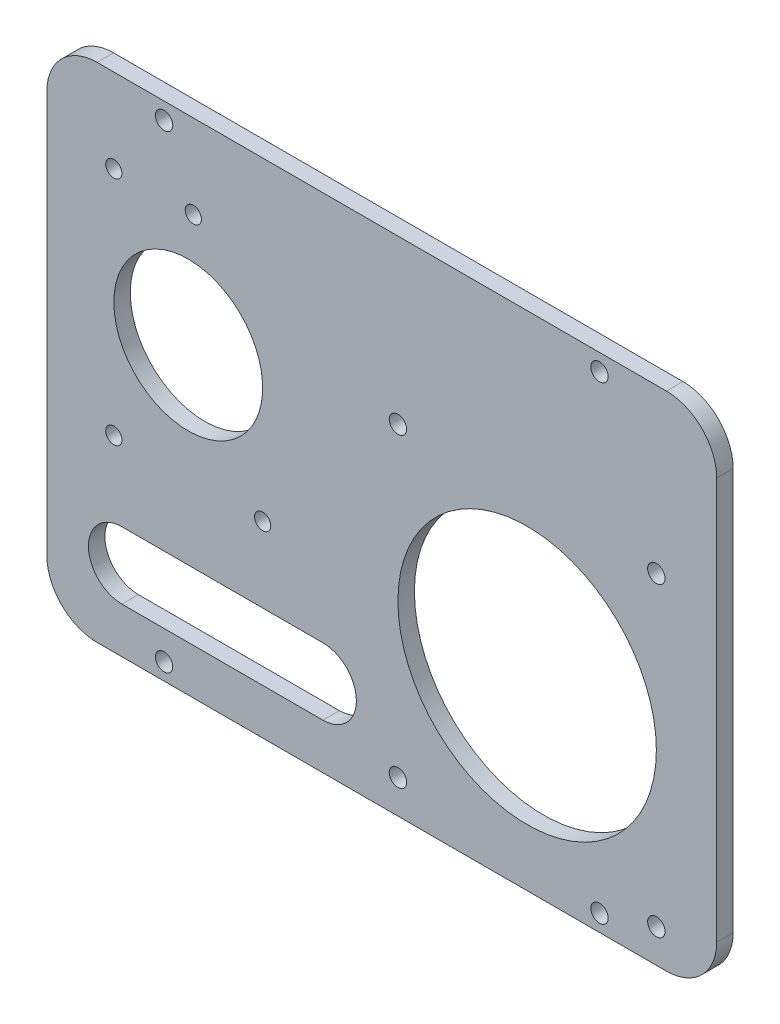
ISO-10303-21;
HEADER;
FILE_DESCRIPTION(('STEP AP214'),'2;1');
FILE_NAME('part.step','',(''),(''),'','','');
FILE_SCHEMA(('AUTOMOTIVE_DESIGN { 1 0 10303 214 1 1 1 1 }'));
ENDSEC;
DATA;
#1=APPLICATION_CONTEXT('core data for automotive mechanical design processes');
#2=APPLICATION_PROTOCOL_DEFINITION('international standard','automotive_design',2000,#1);
#3=PRODUCT_CONTEXT('',#1,'mechanical');
#4=PRODUCT('Part','Part','',(#3));
#5=PRODUCT_RELATED_PRODUCT_CATEGORY('part','',(#4));
#6=PRODUCT_DEFINITION_FORMATION('','',#4);
#7=PRODUCT_DEFINITION_CONTEXT('part definition',#1,'design');
#8=PRODUCT_DEFINITION('design','',#6,#7);
#9=PRODUCT_DEFINITION_SHAPE('','',#8);
#10=(LENGTH_UNIT() NAMED_UNIT(*) SI_UNIT(.MILLI.,.METRE.));
#11=(NAMED_UNIT(*) PLANE_ANGLE_UNIT() SI_UNIT($,.RADIAN.));
#12=(NAMED_UNIT(*) SI_UNIT($,.STERADIAN.) SOLID_ANGLE_UNIT());
#13=UNCERTAINTY_MEASURE_WITH_UNIT(LENGTH_MEASURE(1.E-05),#10,'distance_accuracy_value','');
#14=(GEOMETRIC_REPRESENTATION_CONTEXT(3) GLOBAL_UNCERTAINTY_ASSIGNED_CONTEXT((#13)) GLOBAL_UNIT_ASSIGNED_CONTEXT((#10,
#11,#12)) REPRESENTATION_CONTEXT('',''));
#15=CARTESIAN_POINT('',(0.,0.,0.));
#16=DIRECTION('',(0.,0.,1.));
#17=DIRECTION('',(1.,0.,0.));
#18=AXIS2_PLACEMENT_3D('',#15,#16,#17);
#19=CARTESIAN_POINT('',(-53.975,-38.1,3.1242));
#20=DIRECTION('',(0.,0.,-1.));
#21=DIRECTION('',(-1.,0.,0.));
#22=AXIS2_PLACEMENT_3D('',#19,#20,#21);
#23=CYLINDRICAL_SURFACE('',#22,9.525);
#24=CARTESIAN_POINT('',(-53.975,-38.1,0.));
#25=DIRECTION('',(0.,0.,1.));
#26=DIRECTION('',(-1.,0.,0.));
#27=AXIS2_PLACEMENT_3D('',#24,#25,#26);
#28=CIRCLE('',#27,9.525);
#29=CARTESIAN_POINT('',(-63.5,-38.0999999999999,0.));
#30=VERTEX_POINT('',#29);
#31=CARTESIAN_POINT('',(-53.9749999999999,-47.625,0.));
#32=VERTEX_POINT('',#31);
#33=EDGE_CURVE('E270',#30,#32,#28,.T.);
#34=ORIENTED_EDGE('',*,*,#33,.T.);
#35=DIRECTION('',(0.,0.,-1.));
#36=VECTOR('',#35,1.);
#37=CARTESIAN_POINT('',(-53.9749999999999,-47.625,3.1242));
#38=LINE('',#37,#36);
#39=CARTESIAN_POINT('',(-53.9749999999999,-47.625,3.1242));
#40=VERTEX_POINT('',#39);
#41=EDGE_CURVE('E12',#40,#32,#38,.T.);
#42=ORIENTED_EDGE('',*,*,#41,.F.);
#43=CARTESIAN_POINT('',(-53.975,-38.1,3.1242));
#44=DIRECTION('',(0.,0.,1.));
#45=DIRECTION('',(-1.,0.,0.));
#46=AXIS2_PLACEMENT_3D('',#43,#44,#45);
#47=CIRCLE('',#46,9.525);
#48=CARTESIAN_POINT('',(-63.5,-38.0999999999999,3.1242));
#49=VERTEX_POINT('',#48);
#50=EDGE_CURVE('E276',#49,#40,#47,.T.);
#51=ORIENTED_EDGE('',*,*,#50,.F.);
#52=DIRECTION('',(0.,0.,-1.));
#53=VECTOR('',#52,1.);
#54=CARTESIAN_POINT('',(-63.5,-38.0999999999999,3.1242));
#55=LINE('',#54,#53);
#56=EDGE_CURVE('E293',#49,#30,#55,.T.);
#57=ORIENTED_EDGE('',*,*,#56,.T.);
#58=EDGE_LOOP('',(#34,#42,#51,#57));
#59=FACE_BOUND('',#58,.T.);
#60=ADVANCED_FACE('F40',(#59),#23,.T.);
#61=CARTESIAN_POINT('',(-53.9749999999999,-47.625,3.1242));
#62=DIRECTION('',(0.,1.,0.));
#63=DIRECTION('',(0.,0.,1.));
#64=AXIS2_PLACEMENT_3D('',#61,#62,#63);
#65=PLANE('',#64);
#66=DIRECTION('',(1.,0.,0.));
#67=VECTOR('',#66,1.);
#68=CARTESIAN_POINT('',(-53.9749999999999,-47.625,0.));
#69=LINE('',#68,#67);
#70=CARTESIAN_POINT('',(53.9749999999999,-47.625,0.));
#71=VERTEX_POINT('',#70);
#72=EDGE_CURVE('E297',#32,#71,#69,.T.);
#73=ORIENTED_EDGE('',*,*,#72,.T.);
#74=DIRECTION('',(0.,0.,-1.));
#75=VECTOR('',#74,1.);
#76=CARTESIAN_POINT('',(53.9749999999999,-47.625,3.1242));
#77=LINE('',#76,#75);
#78=CARTESIAN_POINT('',(53.9749999999999,-47.625,3.1242));
#79=VERTEX_POINT('',#78);
#80=EDGE_CURVE('E47',#79,#71,#77,.T.);
#81=ORIENTED_EDGE('',*,*,#80,.F.);
#82=DIRECTION('',(1.,0.,0.));
#83=VECTOR('',#82,1.);
#84=CARTESIAN_POINT('',(-53.9749999999999,-47.625,3.1242));
#85=LINE('',#84,#83);
#86=EDGE_CURVE('E279',#40,#79,#85,.T.);
#87=ORIENTED_EDGE('',*,*,#86,.F.);
#88=ORIENTED_EDGE('',*,*,#41,.T.);
#89=EDGE_LOOP('',(#73,#81,#87,#88));
#90=FACE_BOUND('',#89,.T.);
#91=ADVANCED_FACE('F433',(#90),#65,.F.);
#92=CARTESIAN_POINT('',(53.975,-38.1,3.1242));
#93=DIRECTION('',(0.,0.,-1.));
#94=DIRECTION('',(-1.,0.,0.));
#95=AXIS2_PLACEMENT_3D('',#92,#93,#94);
#96=CYLINDRICAL_SURFACE('',#95,9.525);
#97=CARTESIAN_POINT('',(53.975,-38.1,0.));
#98=DIRECTION('',(0.,0.,1.));
#99=DIRECTION('',(1.,0.,0.));
#100=AXIS2_PLACEMENT_3D('',#97,#98,#99);
#101=CIRCLE('',#100,9.525);
#102=CARTESIAN_POINT('',(63.5,-38.1,0.));
#103=VERTEX_POINT('',#102);
#104=EDGE_CURVE('E301',#71,#103,#101,.T.);
#105=ORIENTED_EDGE('',*,*,#104,.T.);
#106=DIRECTION('',(0.,0.,-1.));
#107=VECTOR('',#106,1.);
#108=CARTESIAN_POINT('',(63.5,-38.1,3.1242));
#109=LINE('',#108,#107);
#110=CARTESIAN_POINT('',(63.5,-38.1,3.1242));
#111=VERTEX_POINT('',#110);
#112=EDGE_CURVE('E341',#111,#103,#109,.T.);
#113=ORIENTED_EDGE('',*,*,#112,.F.);
#114=CARTESIAN_POINT('',(53.975,-38.1,3.1242));
#115=DIRECTION('',(0.,0.,1.));
#116=DIRECTION('',(1.,0.,0.));
#117=AXIS2_PLACEMENT_3D('',#114,#115,#116);
#118=CIRCLE('',#117,9.525);
#119=EDGE_CURVE('E282',#79,#111,#118,.T.);
#120=ORIENTED_EDGE('',*,*,#119,.F.);
#121=ORIENTED_EDGE('',*,*,#80,.T.);
#122=EDGE_LOOP('',(#105,#113,#120,#121));
#123=FACE_BOUND('',#122,.T.);
#124=ADVANCED_FACE('F348',(#123),#96,.T.);
#125=CARTESIAN_POINT('',(63.5,-38.0999999999999,3.1242));
#126=DIRECTION('',(-1.,0.,0.));
#127=DIRECTION('',(0.,0.,1.));
#128=AXIS2_PLACEMENT_3D('',#125,#126,#127);
#129=PLANE('',#128);
#130=DIRECTION('',(0.,1.,0.));
#131=VECTOR('',#130,1.);
#132=CARTESIAN_POINT('',(63.5,-38.0999999999999,0.));
#133=LINE('',#132,#131);
#134=CARTESIAN_POINT('',(63.5,38.0999999999999,0.));
#135=VERTEX_POINT('',#134);
#136=EDGE_CURVE('E305',#103,#135,#133,.T.);
#137=ORIENTED_EDGE('',*,*,#136,.T.);
#138=DIRECTION('',(0.,0.,-1.));
#139=VECTOR('',#138,1.);
#140=CARTESIAN_POINT('',(63.5,38.0999999999999,3.1242));
#141=LINE('',#140,#139);
#142=CARTESIAN_POINT('',(63.5,38.0999999999999,3.1242));
#143=VERTEX_POINT('',#142);
#144=EDGE_CURVE('E338',#143,#135,#141,.T.);
#145=ORIENTED_EDGE('',*,*,#144,.F.);
#146=DIRECTION('',(0.,1.,0.));
#147=VECTOR('',#146,1.);
#148=CARTESIAN_POINT('',(63.5,-38.0999999999999,3.1242));
#149=LINE('',#148,#147);
#150=EDGE_CURVE('E284',#111,#143,#149,.T.);
#151=ORIENTED_EDGE('',*,*,#150,.F.);
#152=ORIENTED_EDGE('',*,*,#112,.T.);
#153=EDGE_LOOP('',(#137,#145,#151,#152));
#154=FACE_BOUND('',#153,.T.);
#155=ADVANCED_FACE('F439',(#154),#129,.F.);
#156=CARTESIAN_POINT('',(53.975,38.1,3.1242));
#157=DIRECTION('',(0.,0.,-1.));
#158=DIRECTION('',(-1.,0.,0.));
#159=AXIS2_PLACEMENT_3D('',#156,#157,#158);
#160=CYLINDRICAL_SURFACE('',#159,9.525);
#161=CARTESIAN_POINT('',(53.975,38.1,0.));
#162=DIRECTION('',(0.,0.,1.));
#163=DIRECTION('',(-1.,0.,0.));
#164=AXIS2_PLACEMENT_3D('',#161,#162,#163);
#165=CIRCLE('',#164,9.525);
#166=CARTESIAN_POINT('',(53.9749999999999,47.625,0.));
#167=VERTEX_POINT('',#166);
#168=EDGE_CURVE('E313',#135,#167,#165,.T.);
#169=ORIENTED_EDGE('',*,*,#168,.T.);
#170=DIRECTION('',(0.,0.,-1.));
#171=VECTOR('',#170,1.);
#172=CARTESIAN_POINT('',(53.9749999999999,47.625,3.1242));
#173=LINE('',#172,#171);
#174=CARTESIAN_POINT('',(53.9749999999999,47.625,3.1242));
#175=VERTEX_POINT('',#174);
#176=EDGE_CURVE('E335',#175,#167,#173,.T.);
#177=ORIENTED_EDGE('',*,*,#176,.F.);
#178=CARTESIAN_POINT('',(53.975,38.1,3.1242));
#179=DIRECTION('',(0.,0.,1.));
#180=DIRECTION('',(-1.,0.,0.));
#181=AXIS2_PLACEMENT_3D('',#178,#179,#180);
#182=CIRCLE('',#181,9.525);
#183=EDGE_CURVE('E286',#143,#175,#182,.T.);
#184=ORIENTED_EDGE('',*,*,#183,.F.);
#185=ORIENTED_EDGE('',*,*,#144,.T.);
#186=EDGE_LOOP('',(#169,#177,#184,#185));
#187=FACE_BOUND('',#186,.T.);
#188=ADVANCED_FACE('F444',(#187),#160,.T.);
#189=CARTESIAN_POINT('',(-53.9749999999999,47.625,3.1242));
#190=DIRECTION('',(0.,-1.,0.));
#191=DIRECTION('',(0.,0.,-1.));
#192=AXIS2_PLACEMENT_3D('',#189,#190,#191);
#193=PLANE('',#192);
#194=DIRECTION('',(-1.,0.,0.));
#195=VECTOR('',#194,1.);
#196=CARTESIAN_POINT('',(-53.9749999999999,47.625,0.));
#197=LINE('',#196,#195);
#198=CARTESIAN_POINT('',(-53.9749999999999,47.625,0.));
#199=VERTEX_POINT('',#198);
#200=EDGE_CURVE('E316',#167,#199,#197,.T.);
#201=ORIENTED_EDGE('',*,*,#200,.T.);
#202=DIRECTION('',(0.,0.,-1.));
#203=VECTOR('',#202,1.);
#204=CARTESIAN_POINT('',(-53.9749999999999,47.625,3.1242));
#205=LINE('',#204,#203);
#206=CARTESIAN_POINT('',(-53.9749999999999,47.625,3.1242));
#207=VERTEX_POINT('',#206);
#208=EDGE_CURVE('E332',#207,#199,#205,.T.);
#209=ORIENTED_EDGE('',*,*,#208,.F.);
#210=DIRECTION('',(-1.,0.,0.));
#211=VECTOR('',#210,1.);
#212=CARTESIAN_POINT('',(-53.9749999999999,47.625,3.1242));
#213=LINE('',#212,#211);
#214=EDGE_CURVE('E288',#175,#207,#213,.T.);
#215=ORIENTED_EDGE('',*,*,#214,.F.);
#216=ORIENTED_EDGE('',*,*,#176,.T.);
#217=EDGE_LOOP('',(#201,#209,#215,#216));
#218=FACE_BOUND('',#217,.T.);
#219=ADVANCED_FACE('F447',(#218),#193,.F.);
#220=CARTESIAN_POINT('',(-53.975,38.1,3.1242));
#221=DIRECTION('',(0.,0.,-1.));
#222=DIRECTION('',(-1.,0.,0.));
#223=AXIS2_PLACEMENT_3D('',#220,#221,#222);
#224=CYLINDRICAL_SURFACE('',#223,9.525);
#225=CARTESIAN_POINT('',(-53.975,38.1,0.));
#226=DIRECTION('',(0.,0.,1.));
#227=DIRECTION('',(-1.,0.,0.));
#228=AXIS2_PLACEMENT_3D('',#225,#226,#227);
#229=CIRCLE('',#228,9.525);
#230=CARTESIAN_POINT('',(-63.5,38.0999999999999,0.));
#231=VERTEX_POINT('',#230);
#232=EDGE_CURVE('E320',#199,#231,#229,.T.);
#233=ORIENTED_EDGE('',*,*,#232,.T.);
#234=DIRECTION('',(0.,0.,-1.));
#235=VECTOR('',#234,1.);
#236=CARTESIAN_POINT('',(-63.5,38.0999999999999,3.1242));
#237=LINE('',#236,#235);
#238=CARTESIAN_POINT('',(-63.5,38.0999999999999,3.1242));
#239=VERTEX_POINT('',#238);
#240=EDGE_CURVE('E329',#239,#231,#237,.T.);
#241=ORIENTED_EDGE('',*,*,#240,.F.);
#242=CARTESIAN_POINT('',(-53.975,38.1,3.1242));
#243=DIRECTION('',(0.,0.,1.));
#244=DIRECTION('',(-1.,0.,0.));
#245=AXIS2_PLACEMENT_3D('',#242,#243,#244);
#246=CIRCLE('',#245,9.525);
#247=EDGE_CURVE('E290',#207,#239,#246,.T.);
#248=ORIENTED_EDGE('',*,*,#247,.F.);
#249=ORIENTED_EDGE('',*,*,#208,.T.);
#250=EDGE_LOOP('',(#233,#241,#248,#249));
#251=FACE_BOUND('',#250,.T.);
#252=ADVANCED_FACE('F451',(#251),#224,.T.);
#253=CARTESIAN_POINT('',(-63.5,-38.0999999999999,3.1242));
#254=DIRECTION('',(1.,0.,0.));
#255=DIRECTION('',(0.,0.,-1.));
#256=AXIS2_PLACEMENT_3D('',#253,#254,#255);
#257=PLANE('',#256);
#258=DIRECTION('',(0.,-1.,0.));
#259=VECTOR('',#258,1.);
#260=CARTESIAN_POINT('',(-63.5,-38.0999999999999,0.));
#261=LINE('',#260,#259);
#262=EDGE_CURVE('E280',#231,#30,#261,.T.);
#263=ORIENTED_EDGE('',*,*,#262,.T.);
#264=ORIENTED_EDGE('',*,*,#56,.F.);
#265=DIRECTION('',(0.,-1.,0.));
#266=VECTOR('',#265,1.);
#267=CARTESIAN_POINT('',(-63.5,-38.0999999999999,3.1242));
#268=LINE('',#267,#266);
#269=EDGE_CURVE('E292',#239,#49,#268,.T.);
#270=ORIENTED_EDGE('',*,*,#269,.F.);
#271=ORIENTED_EDGE('',*,*,#240,.T.);
#272=EDGE_LOOP('',(#263,#264,#270,#271));
#273=FACE_BOUND('',#272,.T.);
#274=ADVANCED_FACE('F425',(#273),#257,.F.);
#275=CARTESIAN_POINT('',(-53.975,-38.1,3.1242));
#276=DIRECTION('',(0.,0.,-1.));
#277=DIRECTION('',(-1.,0.,0.));
#278=AXIS2_PLACEMENT_3D('',#275,#276,#277);
#279=PLANE('',#278);
#280=DIRECTION('',(-1.,0.,0.));
#281=VECTOR('',#280,1.);
#282=CARTESIAN_POINT('',(-11.1633,-26.2763,3.1242));
#283=LINE('',#282,#281);
#284=CARTESIAN_POINT('',(-11.1633,-26.2763,3.1242));
#285=VERTEX_POINT('',#284);
#286=CARTESIAN_POINT('',(-49.2633,-26.2763,3.1242));
#287=VERTEX_POINT('',#286);
#288=EDGE_CURVE('E162',#285,#287,#283,.T.);
#289=ORIENTED_EDGE('',*,*,#288,.F.);
#290=CARTESIAN_POINT('',(-11.1633,-32.6263,3.1242));
#291=DIRECTION('',(0.,0.,-1.));
#292=DIRECTION('',(-1.,0.,0.));
#293=AXIS2_PLACEMENT_3D('',#290,#291,#292);
#294=CIRCLE('',#293,6.35);
#295=CARTESIAN_POINT('',(-11.1633,-38.9763,3.1242));
#296=VERTEX_POINT('',#295);
#297=EDGE_CURVE('E131',#285,#296,#294,.T.);
#298=ORIENTED_EDGE('',*,*,#297,.T.);
#299=DIRECTION('',(-1.,0.,0.));
#300=VECTOR('',#299,1.);
#301=CARTESIAN_POINT('',(-11.1633,-38.9763,3.1242));
#302=LINE('',#301,#300);
#303=CARTESIAN_POINT('',(-49.2633,-38.9763,3.1242));
#304=VERTEX_POINT('',#303);
#305=EDGE_CURVE('E180',#296,#304,#302,.T.);
#306=ORIENTED_EDGE('',*,*,#305,.T.);
#307=CARTESIAN_POINT('',(-49.2633,-32.6263,3.1242));
#308=DIRECTION('',(0.,0.,-1.));
#309=DIRECTION('',(-1.,0.,0.));
#310=AXIS2_PLACEMENT_3D('',#307,#308,#309);
#311=CIRCLE('',#310,6.35);
#312=EDGE_CURVE('E54',#304,#287,#311,.T.);
#313=ORIENTED_EDGE('',*,*,#312,.T.);
#314=EDGE_LOOP('',(#289,#298,#306,#313));
#315=FACE_BOUND('',#314,.T.);
#316=CARTESIAN_POINT('',(-22.5806,-12.0396,3.1242));
#317=DIRECTION('',(0.,0.,-1.));
#318=DIRECTION('',(-1.,0.,0.));
#319=AXIS2_PLACEMENT_3D('',#316,#317,#318);
#320=CIRCLE('',#319,1.5367);
#321=CARTESIAN_POINT('',(-24.1173,-12.0396,3.1242));
#322=VERTEX_POINT('',#321);
#323=EDGE_CURVE('E151',#322,#322,#320,.T.);
#324=ORIENTED_EDGE('',*,*,#323,.T.);
#325=EDGE_LOOP('',(#324));
#326=FACE_BOUND('',#325,.T.);
#327=CARTESIAN_POINT('',(-50.8,-12.0396,3.1242));
#328=DIRECTION('',(0.,0.,-1.));
#329=DIRECTION('',(-1.,0.,0.));
#330=AXIS2_PLACEMENT_3D('',#327,#328,#329);
#331=CIRCLE('',#330,1.5367);
#332=CARTESIAN_POINT('',(-52.3367,-12.0396,3.1242));
#333=VERTEX_POINT('',#332);
#334=EDGE_CURVE('E187',#333,#333,#331,.T.);
#335=ORIENTED_EDGE('',*,*,#334,.T.);
#336=EDGE_LOOP('',(#335));
#337=FACE_BOUND('',#336,.T.);
#338=CARTESIAN_POINT('',(-50.8,31.75,3.1242));
#339=DIRECTION('',(0.,0.,-1.));
#340=DIRECTION('',(-1.,0.,0.));
#341=AXIS2_PLACEMENT_3D('',#338,#339,#340);
#342=CIRCLE('',#341,1.5367);
#343=CARTESIAN_POINT('',(-52.3367,31.75,3.1242));
#344=VERTEX_POINT('',#343);
#345=EDGE_CURVE('E199',#344,#344,#342,.T.);
#346=ORIENTED_EDGE('',*,*,#345,.T.);
#347=EDGE_LOOP('',(#346));
#348=FACE_BOUND('',#347,.T.);
#349=CARTESIAN_POINT('',(-35.7378,31.75,3.1242));
#350=DIRECTION('',(0.,0.,-1.));
#351=DIRECTION('',(-1.,0.,0.));
#352=AXIS2_PLACEMENT_3D('',#349,#350,#351);
#353=CIRCLE('',#352,1.5367);
#354=CARTESIAN_POINT('',(-37.2745,31.75,3.1242));
#355=VERTEX_POINT('',#354);
#356=EDGE_CURVE('E206',#355,#355,#353,.T.);
#357=ORIENTED_EDGE('',*,*,#356,.T.);
#358=EDGE_LOOP('',(#357));
#359=FACE_BOUND('',#358,.T.);
#360=CARTESIAN_POINT('',(-36.6903,9.8552,3.1242));
#361=DIRECTION('',(0.,0.,-1.));
#362=DIRECTION('',(-1.,0.,0.));
#363=AXIS2_PLACEMENT_3D('',#360,#361,#362);
#364=CIRCLE('',#363,14.1097);
#365=CARTESIAN_POINT('',(-50.8,9.8552,3.1242));
#366=VERTEX_POINT('',#365);
#367=EDGE_CURVE('E224',#366,#366,#364,.T.);
#368=ORIENTED_EDGE('',*,*,#367,.T.);
#369=EDGE_LOOP('',(#368));
#370=FACE_BOUND('',#369,.T.);
#371=CARTESIAN_POINT('',(3.0625,-41.275,3.1242));
#372=DIRECTION('',(0.,0.,-1.));
#373=DIRECTION('',(-1.,0.,0.));
#374=AXIS2_PLACEMENT_3D('',#371,#372,#373);
#375=CIRCLE('',#374,1.651);
#376=CARTESIAN_POINT('',(1.4115,-41.275,3.1242));
#377=VERTEX_POINT('',#376);
#378=EDGE_CURVE('E377',#377,#377,#375,.T.);
#379=ORIENTED_EDGE('',*,*,#378,.T.);
#380=EDGE_LOOP('',(#379));
#381=FACE_BOUND('',#380,.T.);
#382=CARTESIAN_POINT('',(52.0625,-41.275,3.1242));
#383=DIRECTION('',(0.,0.,-1.));
#384=DIRECTION('',(-1.,0.,0.));
#385=AXIS2_PLACEMENT_3D('',#382,#383,#384);
#386=CIRCLE('',#385,1.65099999999999);
#387=CARTESIAN_POINT('',(50.4115,-41.275,3.1242));
#388=VERTEX_POINT('',#387);
#389=EDGE_CURVE('E373',#388,#388,#386,.T.);
#390=ORIENTED_EDGE('',*,*,#389,.T.);
#391=EDGE_LOOP('',(#390));
#392=FACE_BOUND('',#391,.T.);
#393=CARTESIAN_POINT('',(52.0625,16.725,3.1242));
#394=DIRECTION('',(0.,0.,-1.));
#395=DIRECTION('',(-1.,0.,0.));
#396=AXIS2_PLACEMENT_3D('',#393,#394,#395);
#397=CIRCLE('',#396,1.651);
#398=CARTESIAN_POINT('',(50.4115,16.725,3.1242));
#399=VERTEX_POINT('',#398);
#400=EDGE_CURVE('E369',#399,#399,#397,.T.);
#401=ORIENTED_EDGE('',*,*,#400,.T.);
#402=EDGE_LOOP('',(#401));
#403=FACE_BOUND('',#402,.T.);
#404=CARTESIAN_POINT('',(3.0625,16.725,3.1242));
#405=DIRECTION('',(0.,0.,-1.));
#406=DIRECTION('',(-1.,0.,0.));
#407=AXIS2_PLACEMENT_3D('',#404,#405,#406);
#408=CIRCLE('',#407,1.65099999999999);
#409=CARTESIAN_POINT('',(1.4115,16.725,3.1242));
#410=VERTEX_POINT('',#409);
#411=EDGE_CURVE('E232',#410,#410,#408,.T.);
#412=ORIENTED_EDGE('',*,*,#411,.T.);
#413=EDGE_LOOP('',(#412));
#414=FACE_BOUND('',#413,.T.);
#415=CARTESIAN_POINT('',(27.5625,-12.275,3.1242));
#416=DIRECTION('',(0.,0.,-1.));
#417=DIRECTION('',(-1.,0.,0.));
#418=AXIS2_PLACEMENT_3D('',#415,#416,#417);
#419=CIRCLE('',#418,24.5);
#420=CARTESIAN_POINT('',(3.06249999999999,-12.275,3.1242));
#421=VERTEX_POINT('',#420);
#422=EDGE_CURVE('E246',#421,#421,#419,.T.);
#423=ORIENTED_EDGE('',*,*,#422,.T.);
#424=EDGE_LOOP('',(#423));
#425=FACE_BOUND('',#424,.T.);
#426=CARTESIAN_POINT('',(-41.275,-44.45,3.1242));
#427=DIRECTION('',(0.,0.,1.));
#428=DIRECTION('',(1.,0.,0.));
#429=AXIS2_PLACEMENT_3D('',#426,#427,#428);
#430=CIRCLE('',#429,1.651);
#431=CARTESIAN_POINT('',(-39.624,-44.45,3.1242));
#432=VERTEX_POINT('',#431);
#433=EDGE_CURVE('E363',#432,#432,#430,.T.);
#434=ORIENTED_EDGE('',*,*,#433,.F.);
#435=EDGE_LOOP('',(#434));
#436=FACE_BOUND('',#435,.T.);
#437=CARTESIAN_POINT('',(41.275,-44.45,3.1242));
#438=DIRECTION('',(0.,0.,1.));
#439=DIRECTION('',(1.,0.,0.));
#440=AXIS2_PLACEMENT_3D('',#437,#438,#439);
#441=CIRCLE('',#440,1.65100000000001);
#442=CARTESIAN_POINT('',(42.926,-44.45,3.1242));
#443=VERTEX_POINT('',#442);
#444=EDGE_CURVE('E257',#443,#443,#441,.T.);
#445=ORIENTED_EDGE('',*,*,#444,.F.);
#446=EDGE_LOOP('',(#445));
#447=FACE_BOUND('',#446,.T.);
#448=CARTESIAN_POINT('',(41.275,44.45,3.1242));
#449=DIRECTION('',(0.,0.,1.));
#450=DIRECTION('',(1.,0.,0.));
#451=AXIS2_PLACEMENT_3D('',#448,#449,#450);
#452=CIRCLE('',#451,1.65100000000001);
#453=CARTESIAN_POINT('',(42.926,44.45,3.1242));
#454=VERTEX_POINT('',#453);
#455=EDGE_CURVE('E248',#454,#454,#452,.T.);
#456=ORIENTED_EDGE('',*,*,#455,.F.);
#457=EDGE_LOOP('',(#456));
#458=FACE_BOUND('',#457,.T.);
#459=CARTESIAN_POINT('',(-41.275,44.45,3.1242));
#460=DIRECTION('',(0.,0.,1.));
#461=DIRECTION('',(1.,0.,0.));
#462=AXIS2_PLACEMENT_3D('',#459,#460,#461);
#463=CIRCLE('',#462,1.651);
#464=CARTESIAN_POINT('',(-39.624,44.45,3.1242));
#465=VERTEX_POINT('',#464);
#466=EDGE_CURVE('E251',#465,#465,#463,.T.);
#467=ORIENTED_EDGE('',*,*,#466,.F.);
#468=EDGE_LOOP('',(#467));
#469=FACE_BOUND('',#468,.T.);
#470=ORIENTED_EDGE('',*,*,#50,.T.);
#471=ORIENTED_EDGE('',*,*,#86,.T.);
#472=ORIENTED_EDGE('',*,*,#119,.T.);
#473=ORIENTED_EDGE('',*,*,#150,.T.);
#474=ORIENTED_EDGE('',*,*,#183,.T.);
#475=ORIENTED_EDGE('',*,*,#214,.T.);
#476=ORIENTED_EDGE('',*,*,#247,.T.);
#477=ORIENTED_EDGE('',*,*,#269,.T.);
#478=EDGE_LOOP('',(#470,#471,#472,#473,#474,#475,#476,#477));
#479=FACE_BOUND('',#478,.T.);
#480=ADVANCED_FACE('F390',(#315,#326,#337,#348,#359,#370,#381,#392,#403,#414,#425,#436,#447,
#458,#469,#479),#279,.F.);
#481=CARTESIAN_POINT('',(-53.975,-38.1,0.));
#482=DIRECTION('',(0.,0.,-1.));
#483=DIRECTION('',(-1.,0.,0.));
#484=AXIS2_PLACEMENT_3D('',#481,#482,#483);
#485=PLANE('',#484);
#486=CARTESIAN_POINT('',(-11.1633,-32.6263,0.));
#487=DIRECTION('',(0.,0.,-1.));
#488=DIRECTION('',(-1.,0.,0.));
#489=AXIS2_PLACEMENT_3D('',#486,#487,#488);
#490=CIRCLE('',#489,6.35);
#491=CARTESIAN_POINT('',(-11.1633,-26.2763,0.));
#492=VERTEX_POINT('',#491);
#493=CARTESIAN_POINT('',(-11.1633,-38.9763,0.));
#494=VERTEX_POINT('',#493);
#495=EDGE_CURVE('E62',#492,#494,#490,.T.);
#496=ORIENTED_EDGE('',*,*,#495,.F.);
#497=DIRECTION('',(-1.,0.,0.));
#498=VECTOR('',#497,1.);
#499=CARTESIAN_POINT('',(-11.1633,-26.2763,0.));
#500=LINE('',#499,#498);
#501=CARTESIAN_POINT('',(-49.2633,-26.2763,0.));
#502=VERTEX_POINT('',#501);
#503=EDGE_CURVE('E137',#492,#502,#500,.T.);
#504=ORIENTED_EDGE('',*,*,#503,.T.);
#505=CARTESIAN_POINT('',(-49.2633,-32.6263,0.));
#506=DIRECTION('',(0.,0.,-1.));
#507=DIRECTION('',(-1.,0.,0.));
#508=AXIS2_PLACEMENT_3D('',#505,#506,#507);
#509=CIRCLE('',#508,6.35);
#510=CARTESIAN_POINT('',(-49.2633,-38.9763,0.));
#511=VERTEX_POINT('',#510);
#512=EDGE_CURVE('E143',#511,#502,#509,.T.);
#513=ORIENTED_EDGE('',*,*,#512,.F.);
#514=DIRECTION('',(-1.,0.,0.));
#515=VECTOR('',#514,1.);
#516=CARTESIAN_POINT('',(-11.1633,-38.9763,0.));
#517=LINE('',#516,#515);
#518=EDGE_CURVE('E149',#494,#511,#517,.T.);
#519=ORIENTED_EDGE('',*,*,#518,.F.);
#520=EDGE_LOOP('',(#496,#504,#513,#519));
#521=FACE_BOUND('',#520,.T.);
#522=CARTESIAN_POINT('',(-22.5806,-12.0396,0.));
#523=DIRECTION('',(0.,0.,-1.));
#524=DIRECTION('',(-1.,0.,0.));
#525=AXIS2_PLACEMENT_3D('',#522,#523,#524);
#526=CIRCLE('',#525,1.5367);
#527=CARTESIAN_POINT('',(-24.1173,-12.0396,0.));
#528=VERTEX_POINT('',#527);
#529=EDGE_CURVE('E154',#528,#528,#526,.T.);
#530=ORIENTED_EDGE('',*,*,#529,.F.);
#531=EDGE_LOOP('',(#530));
#532=FACE_BOUND('',#531,.T.);
#533=CARTESIAN_POINT('',(-50.8,-12.0396,0.));
#534=DIRECTION('',(0.,0.,-1.));
#535=DIRECTION('',(-1.,0.,0.));
#536=AXIS2_PLACEMENT_3D('',#533,#534,#535);
#537=CIRCLE('',#536,1.5367);
#538=CARTESIAN_POINT('',(-52.3367,-12.0396,0.));
#539=VERTEX_POINT('',#538);
#540=EDGE_CURVE('E194',#539,#539,#537,.T.);
#541=ORIENTED_EDGE('',*,*,#540,.F.);
#542=EDGE_LOOP('',(#541));
#543=FACE_BOUND('',#542,.T.);
#544=CARTESIAN_POINT('',(-50.8,31.75,0.));
#545=DIRECTION('',(0.,0.,-1.));
#546=DIRECTION('',(-1.,0.,0.));
#547=AXIS2_PLACEMENT_3D('',#544,#545,#546);
#548=CIRCLE('',#547,1.5367);
#549=CARTESIAN_POINT('',(-52.3367,31.75,0.));
#550=VERTEX_POINT('',#549);
#551=EDGE_CURVE('E201',#550,#550,#548,.T.);
#552=ORIENTED_EDGE('',*,*,#551,.F.);
#553=EDGE_LOOP('',(#552));
#554=FACE_BOUND('',#553,.T.);
#555=CARTESIAN_POINT('',(-35.7378,31.75,0.));
#556=DIRECTION('',(0.,0.,-1.));
#557=DIRECTION('',(-1.,0.,0.));
#558=AXIS2_PLACEMENT_3D('',#555,#556,#557);
#559=CIRCLE('',#558,1.5367);
#560=CARTESIAN_POINT('',(-37.2745,31.75,0.));
#561=VERTEX_POINT('',#560);
#562=EDGE_CURVE('E209',#561,#561,#559,.T.);
#563=ORIENTED_EDGE('',*,*,#562,.F.);
#564=EDGE_LOOP('',(#563));
#565=FACE_BOUND('',#564,.T.);
#566=CARTESIAN_POINT('',(-36.6903,9.8552,0.));
#567=DIRECTION('',(0.,0.,-1.));
#568=DIRECTION('',(-1.,0.,0.));
#569=AXIS2_PLACEMENT_3D('',#566,#567,#568);
#570=CIRCLE('',#569,14.1097);
#571=CARTESIAN_POINT('',(-50.8,9.8552,0.));
#572=VERTEX_POINT('',#571);
#573=EDGE_CURVE('E213',#572,#572,#570,.T.);
#574=ORIENTED_EDGE('',*,*,#573,.F.);
#575=EDGE_LOOP('',(#574));
#576=FACE_BOUND('',#575,.T.);
#577=CARTESIAN_POINT('',(3.0625,-41.275,0.));
#578=DIRECTION('',(0.,0.,-1.));
#579=DIRECTION('',(-1.,0.,0.));
#580=AXIS2_PLACEMENT_3D('',#577,#578,#579);
#581=CIRCLE('',#580,1.651);
#582=CARTESIAN_POINT('',(1.4115,-41.275,0.));
#583=VERTEX_POINT('',#582);
#584=EDGE_CURVE('E375',#583,#583,#581,.T.);
#585=ORIENTED_EDGE('',*,*,#584,.F.);
#586=EDGE_LOOP('',(#585));
#587=FACE_BOUND('',#586,.T.);
#588=CARTESIAN_POINT('',(52.0625,-41.275,0.));
#589=DIRECTION('',(0.,0.,-1.));
#590=DIRECTION('',(-1.,0.,0.));
#591=AXIS2_PLACEMENT_3D('',#588,#589,#590);
#592=CIRCLE('',#591,1.65099999999999);
#593=CARTESIAN_POINT('',(50.4115,-41.275,0.));
#594=VERTEX_POINT('',#593);
#595=EDGE_CURVE('E370',#594,#594,#592,.T.);
#596=ORIENTED_EDGE('',*,*,#595,.F.);
#597=EDGE_LOOP('',(#596));
#598=FACE_BOUND('',#597,.T.);
#599=CARTESIAN_POINT('',(52.0625,16.725,0.));
#600=DIRECTION('',(0.,0.,-1.));
#601=DIRECTION('',(-1.,0.,0.));
#602=AXIS2_PLACEMENT_3D('',#599,#600,#601);
#603=CIRCLE('',#602,1.651);
#604=CARTESIAN_POINT('',(50.4115,16.725,0.));
#605=VERTEX_POINT('',#604);
#606=EDGE_CURVE('E366',#605,#605,#603,.T.);
#607=ORIENTED_EDGE('',*,*,#606,.F.);
#608=EDGE_LOOP('',(#607));
#609=FACE_BOUND('',#608,.T.);
#610=CARTESIAN_POINT('',(3.0625,16.725,0.));
#611=DIRECTION('',(0.,0.,-1.));
#612=DIRECTION('',(-1.,0.,0.));
#613=AXIS2_PLACEMENT_3D('',#610,#611,#612);
#614=CIRCLE('',#613,1.65099999999999);
#615=CARTESIAN_POINT('',(1.4115,16.725,0.));
#616=VERTEX_POINT('',#615);
#617=EDGE_CURVE('E226',#616,#616,#614,.T.);
#618=ORIENTED_EDGE('',*,*,#617,.F.);
#619=EDGE_LOOP('',(#618));
#620=FACE_BOUND('',#619,.T.);
#621=CARTESIAN_POINT('',(27.5625,-12.275,0.));
#622=DIRECTION('',(0.,0.,-1.));
#623=DIRECTION('',(-1.,0.,0.));
#624=AXIS2_PLACEMENT_3D('',#621,#622,#623);
#625=CIRCLE('',#624,24.5);
#626=CARTESIAN_POINT('',(3.06249999999999,-12.275,0.));
#627=VERTEX_POINT('',#626);
#628=EDGE_CURVE('E231',#627,#627,#625,.T.);
#629=ORIENTED_EDGE('',*,*,#628,.F.);
#630=EDGE_LOOP('',(#629));
#631=FACE_BOUND('',#630,.T.);
#632=CARTESIAN_POINT('',(-41.275,-44.45,0.));
#633=DIRECTION('',(0.,0.,1.));
#634=DIRECTION('',(1.,0.,0.));
#635=AXIS2_PLACEMENT_3D('',#632,#633,#634);
#636=CIRCLE('',#635,1.651);
#637=CARTESIAN_POINT('',(-39.624,-44.45,0.));
#638=VERTEX_POINT('',#637);
#639=EDGE_CURVE('E271',#638,#638,#636,.T.);
#640=ORIENTED_EDGE('',*,*,#639,.T.);
#641=EDGE_LOOP('',(#640));
#642=FACE_BOUND('',#641,.T.);
#643=CARTESIAN_POINT('',(41.275,-44.45,0.));
#644=DIRECTION('',(0.,0.,1.));
#645=DIRECTION('',(1.,0.,0.));
#646=AXIS2_PLACEMENT_3D('',#643,#644,#645);
#647=CIRCLE('',#646,1.65100000000001);
#648=CARTESIAN_POINT('',(42.926,-44.45,0.));
#649=VERTEX_POINT('',#648);
#650=EDGE_CURVE('E360',#649,#649,#647,.T.);
#651=ORIENTED_EDGE('',*,*,#650,.T.);
#652=EDGE_LOOP('',(#651));
#653=FACE_BOUND('',#652,.T.);
#654=CARTESIAN_POINT('',(41.275,44.45,0.));
#655=DIRECTION('',(0.,0.,1.));
#656=DIRECTION('',(1.,0.,0.));
#657=AXIS2_PLACEMENT_3D('',#654,#655,#656);
#658=CIRCLE('',#657,1.65100000000001);
#659=CARTESIAN_POINT('',(42.926,44.45,0.));
#660=VERTEX_POINT('',#659);
#661=EDGE_CURVE('E252',#660,#660,#658,.T.);
#662=ORIENTED_EDGE('',*,*,#661,.T.);
#663=EDGE_LOOP('',(#662));
#664=FACE_BOUND('',#663,.T.);
#665=CARTESIAN_POINT('',(-41.275,44.45,0.));
#666=DIRECTION('',(0.,0.,1.));
#667=DIRECTION('',(1.,0.,0.));
#668=AXIS2_PLACEMENT_3D('',#665,#666,#667);
#669=CIRCLE('',#668,1.651);
#670=CARTESIAN_POINT('',(-39.624,44.45,0.));
#671=VERTEX_POINT('',#670);
#672=EDGE_CURVE('E265',#671,#671,#669,.T.);
#673=ORIENTED_EDGE('',*,*,#672,.T.);
#674=EDGE_LOOP('',(#673));
#675=FACE_BOUND('',#674,.T.);
#676=ORIENTED_EDGE('',*,*,#33,.F.);
#677=ORIENTED_EDGE('',*,*,#262,.F.);
#678=ORIENTED_EDGE('',*,*,#232,.F.);
#679=ORIENTED_EDGE('',*,*,#200,.F.);
#680=ORIENTED_EDGE('',*,*,#168,.F.);
#681=ORIENTED_EDGE('',*,*,#136,.F.);
#682=ORIENTED_EDGE('',*,*,#104,.F.);
#683=ORIENTED_EDGE('',*,*,#72,.F.);
#684=EDGE_LOOP('',(#676,#677,#678,#679,#680,#681,#682,#683));
#685=FACE_BOUND('',#684,.T.);
#686=ADVANCED_FACE('F146',(#521,#532,#543,#554,#565,#576,#587,#598,#609,#620,#631,#642,#653,
#664,#675,#685),#485,.T.);
#687=CARTESIAN_POINT('',(-41.275,44.45,0.));
#688=DIRECTION('',(0.,0.,1.));
#689=DIRECTION('',(1.,0.,0.));
#690=AXIS2_PLACEMENT_3D('',#687,#688,#689);
#691=CYLINDRICAL_SURFACE('',#690,1.651);
#692=ORIENTED_EDGE('',*,*,#672,.F.);
#693=EDGE_LOOP('',(#692));
#694=FACE_BOUND('',#693,.T.);
#695=ORIENTED_EDGE('',*,*,#466,.T.);
#696=EDGE_LOOP('',(#695));
#697=FACE_BOUND('',#696,.T.);
#698=ADVANCED_FACE('F403',(#694,#697),#691,.F.);
#699=CARTESIAN_POINT('',(41.275,44.45,0.));
#700=DIRECTION('',(0.,0.,1.));
#701=DIRECTION('',(1.,0.,0.));
#702=AXIS2_PLACEMENT_3D('',#699,#700,#701);
#703=CYLINDRICAL_SURFACE('',#702,1.65100000000001);
#704=ORIENTED_EDGE('',*,*,#661,.F.);
#705=EDGE_LOOP('',(#704));
#706=FACE_BOUND('',#705,.T.);
#707=ORIENTED_EDGE('',*,*,#455,.T.);
#708=EDGE_LOOP('',(#707));
#709=FACE_BOUND('',#708,.T.);
#710=ADVANCED_FACE('F419',(#706,#709),#703,.F.);
#711=CARTESIAN_POINT('',(41.275,-44.45,0.));
#712=DIRECTION('',(0.,0.,1.));
#713=DIRECTION('',(1.,0.,0.));
#714=AXIS2_PLACEMENT_3D('',#711,#712,#713);
#715=CYLINDRICAL_SURFACE('',#714,1.65100000000001);
#716=ORIENTED_EDGE('',*,*,#650,.F.);
#717=EDGE_LOOP('',(#716));
#718=FACE_BOUND('',#717,.T.);
#719=ORIENTED_EDGE('',*,*,#444,.T.);
#720=EDGE_LOOP('',(#719));
#721=FACE_BOUND('',#720,.T.);
#722=ADVANCED_FACE('F463',(#718,#721),#715,.F.);
#723=CARTESIAN_POINT('',(-41.275,-44.45,0.));
#724=DIRECTION('',(0.,0.,1.));
#725=DIRECTION('',(1.,0.,0.));
#726=AXIS2_PLACEMENT_3D('',#723,#724,#725);
#727=CYLINDRICAL_SURFACE('',#726,1.651);
#728=ORIENTED_EDGE('',*,*,#639,.F.);
#729=EDGE_LOOP('',(#728));
#730=FACE_BOUND('',#729,.T.);
#731=ORIENTED_EDGE('',*,*,#433,.T.);
#732=EDGE_LOOP('',(#731));
#733=FACE_BOUND('',#732,.T.);
#734=ADVANCED_FACE('F459',(#730,#733),#727,.F.);
#735=CARTESIAN_POINT('',(27.5625,-12.275,3.1242));
#736=DIRECTION('',(0.,0.,-1.));
#737=DIRECTION('',(-1.,0.,0.));
#738=AXIS2_PLACEMENT_3D('',#735,#736,#737);
#739=CYLINDRICAL_SURFACE('',#738,24.5);
#740=ORIENTED_EDGE('',*,*,#422,.F.);
#741=EDGE_LOOP('',(#740));
#742=FACE_BOUND('',#741,.T.);
#743=ORIENTED_EDGE('',*,*,#628,.T.);
#744=EDGE_LOOP('',(#743));
#745=FACE_BOUND('',#744,.T.);
#746=ADVANCED_FACE('F462',(#742,#745),#739,.F.);
#747=CARTESIAN_POINT('',(3.0625,16.725,3.1242));
#748=DIRECTION('',(0.,0.,-1.));
#749=DIRECTION('',(-1.,0.,0.));
#750=AXIS2_PLACEMENT_3D('',#747,#748,#749);
#751=CYLINDRICAL_SURFACE('',#750,1.65099999999999);
#752=ORIENTED_EDGE('',*,*,#411,.F.);
#753=EDGE_LOOP('',(#752));
#754=FACE_BOUND('',#753,.T.);
#755=ORIENTED_EDGE('',*,*,#617,.T.);
#756=EDGE_LOOP('',(#755));
#757=FACE_BOUND('',#756,.T.);
#758=ADVANCED_FACE('F397',(#754,#757),#751,.F.);
#759=CARTESIAN_POINT('',(52.0625,16.725,3.1242));
#760=DIRECTION('',(0.,0.,-1.));
#761=DIRECTION('',(-1.,0.,0.));
#762=AXIS2_PLACEMENT_3D('',#759,#760,#761);
#763=CYLINDRICAL_SURFACE('',#762,1.651);
#764=ORIENTED_EDGE('',*,*,#400,.F.);
#765=EDGE_LOOP('',(#764));
#766=FACE_BOUND('',#765,.T.);
#767=ORIENTED_EDGE('',*,*,#606,.T.);
#768=EDGE_LOOP('',(#767));
#769=FACE_BOUND('',#768,.T.);
#770=ADVANCED_FACE('F393',(#766,#769),#763,.F.);
#771=CARTESIAN_POINT('',(52.0625,-41.275,3.1242));
#772=DIRECTION('',(0.,0.,-1.));
#773=DIRECTION('',(-1.,0.,0.));
#774=AXIS2_PLACEMENT_3D('',#771,#772,#773);
#775=CYLINDRICAL_SURFACE('',#774,1.65099999999999);
#776=ORIENTED_EDGE('',*,*,#389,.F.);
#777=EDGE_LOOP('',(#776));
#778=FACE_BOUND('',#777,.T.);
#779=ORIENTED_EDGE('',*,*,#595,.T.);
#780=EDGE_LOOP('',(#779));
#781=FACE_BOUND('',#780,.T.);
#782=ADVANCED_FACE('F396',(#778,#781),#775,.F.);
#783=CARTESIAN_POINT('',(3.0625,-41.275,3.1242));
#784=DIRECTION('',(0.,0.,-1.));
#785=DIRECTION('',(-1.,0.,0.));
#786=AXIS2_PLACEMENT_3D('',#783,#784,#785);
#787=CYLINDRICAL_SURFACE('',#786,1.651);
#788=ORIENTED_EDGE('',*,*,#378,.F.);
#789=EDGE_LOOP('',(#788));
#790=FACE_BOUND('',#789,.T.);
#791=ORIENTED_EDGE('',*,*,#584,.T.);
#792=EDGE_LOOP('',(#791));
#793=FACE_BOUND('',#792,.T.);
#794=ADVANCED_FACE('F474',(#790,#793),#787,.F.);
#795=CARTESIAN_POINT('',(-36.6903,9.8552,3.1242));
#796=DIRECTION('',(0.,0.,-1.));
#797=DIRECTION('',(-1.,0.,0.));
#798=AXIS2_PLACEMENT_3D('',#795,#796,#797);
#799=CYLINDRICAL_SURFACE('',#798,14.1097);
#800=ORIENTED_EDGE('',*,*,#367,.F.);
#801=EDGE_LOOP('',(#800));
#802=FACE_BOUND('',#801,.T.);
#803=ORIENTED_EDGE('',*,*,#573,.T.);
#804=EDGE_LOOP('',(#803));
#805=FACE_BOUND('',#804,.T.);
#806=ADVANCED_FACE('F477',(#802,#805),#799,.F.);
#807=CARTESIAN_POINT('',(-35.7378,31.75,3.1242));
#808=DIRECTION('',(0.,0.,-1.));
#809=DIRECTION('',(-1.,0.,0.));
#810=AXIS2_PLACEMENT_3D('',#807,#808,#809);
#811=CYLINDRICAL_SURFACE('',#810,1.5367);
#812=ORIENTED_EDGE('',*,*,#356,.F.);
#813=EDGE_LOOP('',(#812));
#814=FACE_BOUND('',#813,.T.);
#815=ORIENTED_EDGE('',*,*,#562,.T.);
#816=EDGE_LOOP('',(#815));
#817=FACE_BOUND('',#816,.T.);
#818=ADVANCED_FACE('F487',(#814,#817),#811,.F.);
#819=CARTESIAN_POINT('',(-50.8,31.75,3.1242));
#820=DIRECTION('',(0.,0.,-1.));
#821=DIRECTION('',(-1.,0.,0.));
#822=AXIS2_PLACEMENT_3D('',#819,#820,#821);
#823=CYLINDRICAL_SURFACE('',#822,1.5367);
#824=ORIENTED_EDGE('',*,*,#345,.F.);
#825=EDGE_LOOP('',(#824));
#826=FACE_BOUND('',#825,.T.);
#827=ORIENTED_EDGE('',*,*,#551,.T.);
#828=EDGE_LOOP('',(#827));
#829=FACE_BOUND('',#828,.T.);
#830=ADVANCED_FACE('F504',(#826,#829),#823,.F.);
#831=CARTESIAN_POINT('',(-50.8,-12.0396,3.1242));
#832=DIRECTION('',(0.,0.,-1.));
#833=DIRECTION('',(-1.,0.,0.));
#834=AXIS2_PLACEMENT_3D('',#831,#832,#833);
#835=CYLINDRICAL_SURFACE('',#834,1.5367);
#836=ORIENTED_EDGE('',*,*,#334,.F.);
#837=EDGE_LOOP('',(#836));
#838=FACE_BOUND('',#837,.T.);
#839=ORIENTED_EDGE('',*,*,#540,.T.);
#840=EDGE_LOOP('',(#839));
#841=FACE_BOUND('',#840,.T.);
#842=ADVANCED_FACE('F500',(#838,#841),#835,.F.);
#843=CARTESIAN_POINT('',(-22.5806,-12.0396,3.1242));
#844=DIRECTION('',(0.,0.,-1.));
#845=DIRECTION('',(-1.,0.,0.));
#846=AXIS2_PLACEMENT_3D('',#843,#844,#845);
#847=CYLINDRICAL_SURFACE('',#846,1.5367);
#848=ORIENTED_EDGE('',*,*,#323,.F.);
#849=EDGE_LOOP('',(#848));
#850=FACE_BOUND('',#849,.T.);
#851=ORIENTED_EDGE('',*,*,#529,.T.);
#852=EDGE_LOOP('',(#851));
#853=FACE_BOUND('',#852,.T.);
#854=ADVANCED_FACE('F497',(#850,#853),#847,.F.);
#855=CARTESIAN_POINT('',(-11.1633,-32.6263,3.1242));
#856=DIRECTION('',(0.,0.,-1.));
#857=DIRECTION('',(-1.,0.,0.));
#858=AXIS2_PLACEMENT_3D('',#855,#856,#857);
#859=CYLINDRICAL_SURFACE('',#858,6.35);
#860=ORIENTED_EDGE('',*,*,#495,.T.);
#861=DIRECTION('',(0.,0.,-1.));
#862=VECTOR('',#861,1.);
#863=CARTESIAN_POINT('',(-11.1633,-38.9763,3.1242));
#864=LINE('',#863,#862);
#865=EDGE_CURVE('E177',#296,#494,#864,.T.);
#866=ORIENTED_EDGE('',*,*,#865,.F.);
#867=ORIENTED_EDGE('',*,*,#297,.F.);
#868=DIRECTION('',(0.,0.,-1.));
#869=VECTOR('',#868,1.);
#870=CARTESIAN_POINT('',(-11.1633,-26.2763,3.1242));
#871=LINE('',#870,#869);
#872=EDGE_CURVE('E127',#285,#492,#871,.T.);
#873=ORIENTED_EDGE('',*,*,#872,.T.);
#874=EDGE_LOOP('',(#860,#866,#867,#873));
#875=FACE_BOUND('',#874,.T.);
#876=ADVANCED_FACE('F129',(#875),#859,.F.);
#877=CARTESIAN_POINT('',(-11.1633,-26.2763,3.1242));
#878=DIRECTION('',(0.,-1.,0.));
#879=DIRECTION('',(0.,0.,-1.));
#880=AXIS2_PLACEMENT_3D('',#877,#878,#879);
#881=PLANE('',#880);
#882=ORIENTED_EDGE('',*,*,#503,.F.);
#883=ORIENTED_EDGE('',*,*,#872,.F.);
#884=ORIENTED_EDGE('',*,*,#288,.T.);
#885=DIRECTION('',(0.,0.,-1.));
#886=VECTOR('',#885,1.);
#887=CARTESIAN_POINT('',(-49.2633,-26.2763,3.1242));
#888=LINE('',#887,#886);
#889=EDGE_CURVE('E134',#287,#502,#888,.T.);
#890=ORIENTED_EDGE('',*,*,#889,.T.);
#891=EDGE_LOOP('',(#882,#883,#884,#890));
#892=FACE_BOUND('',#891,.T.);
#893=ADVANCED_FACE('F138',(#892),#881,.T.);
#894=CARTESIAN_POINT('',(-49.2633,-32.6263,3.1242));
#895=DIRECTION('',(0.,0.,-1.));
#896=DIRECTION('',(-1.,0.,0.));
#897=AXIS2_PLACEMENT_3D('',#894,#895,#896);
#898=CYLINDRICAL_SURFACE('',#897,6.35);
#899=ORIENTED_EDGE('',*,*,#512,.T.);
#900=ORIENTED_EDGE('',*,*,#889,.F.);
#901=ORIENTED_EDGE('',*,*,#312,.F.);
#902=DIRECTION('',(0.,0.,-1.));
#903=VECTOR('',#902,1.);
#904=CARTESIAN_POINT('',(-49.2633,-38.9763,3.1242));
#905=LINE('',#904,#903);
#906=EDGE_CURVE('E173',#304,#511,#905,.T.);
#907=ORIENTED_EDGE('',*,*,#906,.T.);
#908=EDGE_LOOP('',(#899,#900,#901,#907));
#909=FACE_BOUND('',#908,.T.);
#910=ADVANCED_FACE('F172',(#909),#898,.F.);
#911=CARTESIAN_POINT('',(-11.1633,-38.9763,3.1242));
#912=DIRECTION('',(0.,-1.,0.));
#913=DIRECTION('',(0.,0.,-1.));
#914=AXIS2_PLACEMENT_3D('',#911,#912,#913);
#915=PLANE('',#914);
#916=ORIENTED_EDGE('',*,*,#518,.T.);
#917=ORIENTED_EDGE('',*,*,#906,.F.);
#918=ORIENTED_EDGE('',*,*,#305,.F.);
#919=ORIENTED_EDGE('',*,*,#865,.T.);
#920=EDGE_LOOP('',(#916,#917,#918,#919));
#921=FACE_BOUND('',#920,.T.);
#922=ADVANCED_FACE('F179',(#921),#915,.F.);
#923=CLOSED_SHELL('',(#60,#91,#124,#155,#188,#219,#252,#274,#480,#686,#698,#710,#722,#734,#746,
#758,#770,#782,#794,#806,#818,#830,#842,#854,#876,#893,#910,#922));
#924=MANIFOLD_SOLID_BREP('B2',#923);
#925=ADVANCED_BREP_SHAPE_REPRESENTATION('',(#18,#924),#14);
#926=SHAPE_DEFINITION_REPRESENTATION(#9,#925);
ENDSEC;
END-ISO-10303-21;
